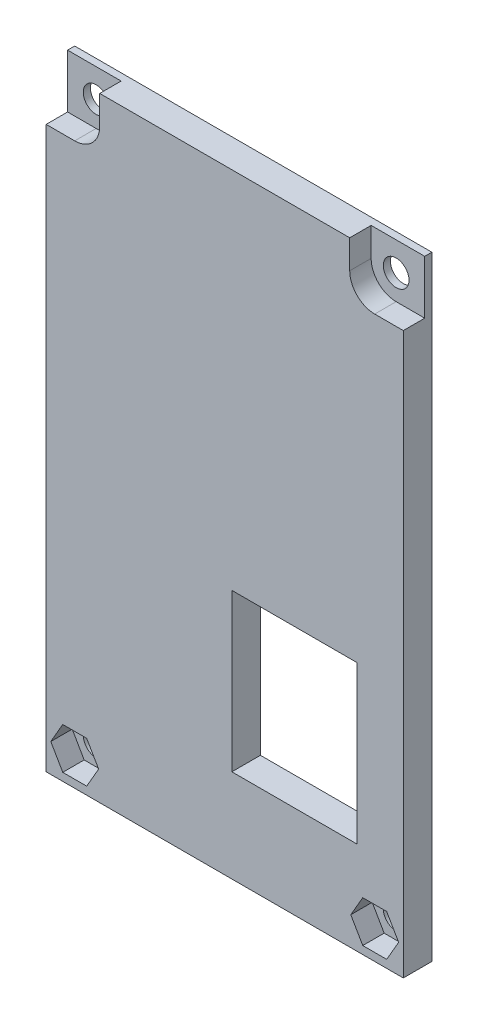
ISO-10303-21;
HEADER;
FILE_DESCRIPTION(('STEP AP214'),'2;1');
FILE_NAME('part.step','',(''),(''),'','','');
FILE_SCHEMA(('AUTOMOTIVE_DESIGN { 1 0 10303 214 1 1 1 1 }'));
ENDSEC;
DATA;
#1=APPLICATION_CONTEXT('core data for automotive mechanical design processes');
#2=APPLICATION_PROTOCOL_DEFINITION('international standard','automotive_design',2000,#1);
#3=PRODUCT_CONTEXT('',#1,'mechanical');
#4=PRODUCT('Part','Part','',(#3));
#5=PRODUCT_RELATED_PRODUCT_CATEGORY('part','',(#4));
#6=PRODUCT_DEFINITION_FORMATION('','',#4);
#7=PRODUCT_DEFINITION_CONTEXT('part definition',#1,'design');
#8=PRODUCT_DEFINITION('design','',#6,#7);
#9=PRODUCT_DEFINITION_SHAPE('','',#8);
#10=(LENGTH_UNIT() NAMED_UNIT(*) SI_UNIT(.MILLI.,.METRE.));
#11=(NAMED_UNIT(*) PLANE_ANGLE_UNIT() SI_UNIT($,.RADIAN.));
#12=(NAMED_UNIT(*) SI_UNIT($,.STERADIAN.) SOLID_ANGLE_UNIT());
#13=UNCERTAINTY_MEASURE_WITH_UNIT(LENGTH_MEASURE(1.E-05),#10,'distance_accuracy_value','');
#14=(GEOMETRIC_REPRESENTATION_CONTEXT(3) GLOBAL_UNCERTAINTY_ASSIGNED_CONTEXT((#13)) GLOBAL_UNIT_ASSIGNED_CONTEXT((#10,
#11,#12)) REPRESENTATION_CONTEXT('',''));
#15=CARTESIAN_POINT('',(0.,0.,0.));
#16=DIRECTION('',(0.,0.,1.));
#17=DIRECTION('',(1.,0.,0.));
#18=AXIS2_PLACEMENT_3D('',#15,#16,#17);
#19=CARTESIAN_POINT('',(575.,343.,4.));
#20=DIRECTION('',(0.,1.,0.));
#21=DIRECTION('',(0.,0.,1.));
#22=AXIS2_PLACEMENT_3D('',#19,#20,#21);
#23=PLANE('',#22);
#24=DIRECTION('',(0.,0.,1.));
#25=VECTOR('',#24,1.);
#26=CARTESIAN_POINT('',(617.5,343.,1.));
#27=LINE('',#26,#25);
#28=CARTESIAN_POINT('',(617.5,343.,1.));
#29=VERTEX_POINT('',#28);
#30=CARTESIAN_POINT('',(617.5,343.,4.));
#31=VERTEX_POINT('',#30);
#32=EDGE_CURVE('E282',#29,#31,#27,.T.);
#33=ORIENTED_EDGE('',*,*,#32,.F.);
#34=DIRECTION('',(-1.,0.,0.));
#35=VECTOR('',#34,1.);
#36=CARTESIAN_POINT('',(625.,343.,1.));
#37=LINE('',#36,#35);
#38=CARTESIAN_POINT('',(625.,343.,1.));
#39=VERTEX_POINT('',#38);
#40=EDGE_CURVE('E271',#39,#29,#37,.T.);
#41=ORIENTED_EDGE('',*,*,#40,.F.);
#42=DIRECTION('',(0.,0.,-1.));
#43=VECTOR('',#42,1.);
#44=CARTESIAN_POINT('',(625.,343.,4.));
#45=LINE('',#44,#43);
#46=CARTESIAN_POINT('',(625.,343.,0.));
#47=VERTEX_POINT('',#46);
#48=EDGE_CURVE('E410',#39,#47,#45,.T.);
#49=ORIENTED_EDGE('',*,*,#48,.T.);
#50=DIRECTION('',(1.,0.,0.));
#51=VECTOR('',#50,1.);
#52=CARTESIAN_POINT('',(575.,343.,0.));
#53=LINE('',#52,#51);
#54=CARTESIAN_POINT('',(575.,343.,0.));
#55=VERTEX_POINT('',#54);
#56=EDGE_CURVE('E391',#55,#47,#53,.T.);
#57=ORIENTED_EDGE('',*,*,#56,.F.);
#58=DIRECTION('',(0.,0.,-1.));
#59=VECTOR('',#58,1.);
#60=CARTESIAN_POINT('',(575.,343.,4.));
#61=LINE('',#60,#59);
#62=CARTESIAN_POINT('',(575.,343.,1.));
#63=VERTEX_POINT('',#62);
#64=EDGE_CURVE('E421',#63,#55,#61,.T.);
#65=ORIENTED_EDGE('',*,*,#64,.F.);
#66=DIRECTION('',(-1.,0.,0.));
#67=VECTOR('',#66,1.);
#68=CARTESIAN_POINT('',(582.5,343.,1.));
#69=LINE('',#68,#67);
#70=CARTESIAN_POINT('',(582.5,343.,1.));
#71=VERTEX_POINT('',#70);
#72=EDGE_CURVE('E303',#71,#63,#69,.T.);
#73=ORIENTED_EDGE('',*,*,#72,.F.);
#74=DIRECTION('',(0.,0.,-1.));
#75=VECTOR('',#74,1.);
#76=CARTESIAN_POINT('',(582.5,343.,4.));
#77=LINE('',#76,#75);
#78=CARTESIAN_POINT('',(582.5,343.,4.));
#79=VERTEX_POINT('',#78);
#80=EDGE_CURVE('E295',#79,#71,#77,.T.);
#81=ORIENTED_EDGE('',*,*,#80,.F.);
#82=DIRECTION('',(1.,0.,0.));
#83=VECTOR('',#82,1.);
#84=CARTESIAN_POINT('',(575.,343.,4.));
#85=LINE('',#84,#83);
#86=EDGE_CURVE('E398',#79,#31,#85,.T.);
#87=ORIENTED_EDGE('',*,*,#86,.T.);
#88=EDGE_LOOP('',(#33,#41,#49,#57,#65,#73,#81,#87));
#89=FACE_BOUND('',#88,.T.);
#90=ADVANCED_FACE('F33',(#89),#23,.T.);
#91=CARTESIAN_POINT('',(575.,257.,4.));
#92=DIRECTION('',(-1.,0.,0.));
#93=DIRECTION('',(0.,0.,1.));
#94=AXIS2_PLACEMENT_3D('',#91,#92,#93);
#95=PLANE('',#94);
#96=DIRECTION('',(0.,1.,0.));
#97=VECTOR('',#96,1.);
#98=CARTESIAN_POINT('',(575.,335.5,1.));
#99=LINE('',#98,#97);
#100=CARTESIAN_POINT('',(575.,335.5,1.));
#101=VERTEX_POINT('',#100);
#102=EDGE_CURVE('E311',#101,#63,#99,.T.);
#103=ORIENTED_EDGE('',*,*,#102,.T.);
#104=ORIENTED_EDGE('',*,*,#64,.T.);
#105=DIRECTION('',(0.,1.,0.));
#106=VECTOR('',#105,1.);
#107=CARTESIAN_POINT('',(575.,257.,0.));
#108=LINE('',#107,#106);
#109=CARTESIAN_POINT('',(575.,257.,0.));
#110=VERTEX_POINT('',#109);
#111=EDGE_CURVE('E402',#110,#55,#108,.T.);
#112=ORIENTED_EDGE('',*,*,#111,.F.);
#113=DIRECTION('',(0.,0.,-1.));
#114=VECTOR('',#113,1.);
#115=CARTESIAN_POINT('',(575.,257.,4.));
#116=LINE('',#115,#114);
#117=CARTESIAN_POINT('',(575.,257.,4.));
#118=VERTEX_POINT('',#117);
#119=EDGE_CURVE('E424',#118,#110,#116,.T.);
#120=ORIENTED_EDGE('',*,*,#119,.F.);
#121=DIRECTION('',(0.,1.,0.));
#122=VECTOR('',#121,1.);
#123=CARTESIAN_POINT('',(575.,257.,4.));
#124=LINE('',#123,#122);
#125=CARTESIAN_POINT('',(575.,335.5,4.));
#126=VERTEX_POINT('',#125);
#127=EDGE_CURVE('E407',#118,#126,#124,.T.);
#128=ORIENTED_EDGE('',*,*,#127,.T.);
#129=DIRECTION('',(0.,0.,1.));
#130=VECTOR('',#129,1.);
#131=CARTESIAN_POINT('',(575.,335.5,1.));
#132=LINE('',#131,#130);
#133=EDGE_CURVE('E305',#101,#126,#132,.T.);
#134=ORIENTED_EDGE('',*,*,#133,.F.);
#135=EDGE_LOOP('',(#103,#104,#112,#120,#128,#134));
#136=FACE_BOUND('',#135,.T.);
#137=ADVANCED_FACE('F473',(#136),#95,.T.);
#138=CARTESIAN_POINT('',(625.,257.,4.));
#139=DIRECTION('',(0.,-1.,0.));
#140=DIRECTION('',(0.,0.,-1.));
#141=AXIS2_PLACEMENT_3D('',#138,#139,#140);
#142=PLANE('',#141);
#143=DIRECTION('',(-1.,0.,0.));
#144=VECTOR('',#143,1.);
#145=CARTESIAN_POINT('',(625.,257.,0.));
#146=LINE('',#145,#144);
#147=CARTESIAN_POINT('',(625.,257.,0.));
#148=VERTEX_POINT('',#147);
#149=EDGE_CURVE('E416',#148,#110,#146,.T.);
#150=ORIENTED_EDGE('',*,*,#149,.F.);
#151=DIRECTION('',(0.,0.,-1.));
#152=VECTOR('',#151,1.);
#153=CARTESIAN_POINT('',(625.,257.,4.));
#154=LINE('',#153,#152);
#155=CARTESIAN_POINT('',(625.,257.,4.));
#156=VERTEX_POINT('',#155);
#157=EDGE_CURVE('E426',#156,#148,#154,.T.);
#158=ORIENTED_EDGE('',*,*,#157,.F.);
#159=DIRECTION('',(-1.,0.,0.));
#160=VECTOR('',#159,1.);
#161=CARTESIAN_POINT('',(625.,257.,4.));
#162=LINE('',#161,#160);
#163=EDGE_CURVE('E404',#156,#118,#162,.T.);
#164=ORIENTED_EDGE('',*,*,#163,.T.);
#165=ORIENTED_EDGE('',*,*,#119,.T.);
#166=EDGE_LOOP('',(#150,#158,#164,#165));
#167=FACE_BOUND('',#166,.T.);
#168=ADVANCED_FACE('F480',(#167),#142,.T.);
#169=CARTESIAN_POINT('',(625.,343.,4.));
#170=DIRECTION('',(1.,0.,0.));
#171=DIRECTION('',(0.,0.,-1.));
#172=AXIS2_PLACEMENT_3D('',#169,#170,#171);
#173=PLANE('',#172);
#174=DIRECTION('',(0.,1.,0.));
#175=VECTOR('',#174,1.);
#176=CARTESIAN_POINT('',(625.,335.5,1.));
#177=LINE('',#176,#175);
#178=CARTESIAN_POINT('',(625.,335.5,1.));
#179=VERTEX_POINT('',#178);
#180=EDGE_CURVE('E288',#179,#39,#177,.T.);
#181=ORIENTED_EDGE('',*,*,#180,.F.);
#182=DIRECTION('',(0.,0.,-1.));
#183=VECTOR('',#182,1.);
#184=CARTESIAN_POINT('',(625.,335.5,4.));
#185=LINE('',#184,#183);
#186=CARTESIAN_POINT('',(625.,335.5,4.));
#187=VERTEX_POINT('',#186);
#188=EDGE_CURVE('E281',#187,#179,#185,.T.);
#189=ORIENTED_EDGE('',*,*,#188,.F.);
#190=DIRECTION('',(0.,-1.,0.));
#191=VECTOR('',#190,1.);
#192=CARTESIAN_POINT('',(625.,343.,4.));
#193=LINE('',#192,#191);
#194=EDGE_CURVE('E401',#187,#156,#193,.T.);
#195=ORIENTED_EDGE('',*,*,#194,.T.);
#196=ORIENTED_EDGE('',*,*,#157,.T.);
#197=DIRECTION('',(0.,-1.,0.));
#198=VECTOR('',#197,1.);
#199=CARTESIAN_POINT('',(625.,343.,0.));
#200=LINE('',#199,#198);
#201=EDGE_CURVE('E413',#47,#148,#200,.T.);
#202=ORIENTED_EDGE('',*,*,#201,.F.);
#203=ORIENTED_EDGE('',*,*,#48,.F.);
#204=EDGE_LOOP('',(#181,#189,#195,#196,#202,#203));
#205=FACE_BOUND('',#204,.T.);
#206=ADVANCED_FACE('F484',(#205),#173,.T.);
#207=CARTESIAN_POINT('',(0.,0.,4.));
#208=DIRECTION('',(0.,0.,-1.));
#209=DIRECTION('',(-1.,0.,0.));
#210=AXIS2_PLACEMENT_3D('',#207,#208,#209);
#211=PLANE('',#210);
#212=DIRECTION('',(-0.499999999999986,0.866025403784447,0.));
#213=VECTOR('',#212,1.);
#214=CARTESIAN_POINT('',(624.35,261.,4.));
#215=LINE('',#214,#213);
#216=CARTESIAN_POINT('',(624.35,261.,4.));
#217=VERTEX_POINT('',#216);
#218=CARTESIAN_POINT('',(622.675,263.901185102678,4.));
#219=VERTEX_POINT('',#218);
#220=EDGE_CURVE('E258',#217,#219,#215,.T.);
#221=ORIENTED_EDGE('',*,*,#220,.F.);
#222=DIRECTION('',(0.499999999999978,0.866025403784451,0.));
#223=VECTOR('',#222,1.);
#224=CARTESIAN_POINT('',(622.675,258.098814897322,4.));
#225=LINE('',#224,#223);
#226=CARTESIAN_POINT('',(622.675,258.098814897322,4.));
#227=VERTEX_POINT('',#226);
#228=EDGE_CURVE('E223',#227,#217,#225,.T.);
#229=ORIENTED_EDGE('',*,*,#228,.F.);
#230=DIRECTION('',(1.,0.,0.));
#231=VECTOR('',#230,1.);
#232=CARTESIAN_POINT('',(619.325,258.098814897322,4.));
#233=LINE('',#232,#231);
#234=CARTESIAN_POINT('',(619.325,258.098814897322,4.));
#235=VERTEX_POINT('',#234);
#236=EDGE_CURVE('E241',#235,#227,#233,.T.);
#237=ORIENTED_EDGE('',*,*,#236,.F.);
#238=DIRECTION('',(0.499999999999978,-0.866025403784451,0.));
#239=VECTOR('',#238,1.);
#240=CARTESIAN_POINT('',(617.65,261.,4.));
#241=LINE('',#240,#239);
#242=CARTESIAN_POINT('',(617.65,261.,4.));
#243=VERTEX_POINT('',#242);
#244=EDGE_CURVE('E244',#243,#235,#241,.T.);
#245=ORIENTED_EDGE('',*,*,#244,.F.);
#246=DIRECTION('',(-0.499999999999986,-0.866025403784447,0.));
#247=VECTOR('',#246,1.);
#248=CARTESIAN_POINT('',(619.325,263.901185102678,4.));
#249=LINE('',#248,#247);
#250=CARTESIAN_POINT('',(619.325,263.901185102678,4.));
#251=VERTEX_POINT('',#250);
#252=EDGE_CURVE('E264',#251,#243,#249,.T.);
#253=ORIENTED_EDGE('',*,*,#252,.F.);
#254=DIRECTION('',(-1.,0.,0.));
#255=VECTOR('',#254,1.);
#256=CARTESIAN_POINT('',(622.675,263.901185102678,4.));
#257=LINE('',#256,#255);
#258=EDGE_CURVE('E261',#219,#251,#257,.T.);
#259=ORIENTED_EDGE('',*,*,#258,.F.);
#260=EDGE_LOOP('',(#221,#229,#237,#245,#253,#259));
#261=FACE_BOUND('',#260,.T.);
#262=DIRECTION('',(0.499999999999978,0.866025403784451,0.));
#263=VECTOR('',#262,1.);
#264=CARTESIAN_POINT('',(580.675,258.098814897322,4.));
#265=LINE('',#264,#263);
#266=CARTESIAN_POINT('',(580.675,258.098814897322,4.));
#267=VERTEX_POINT('',#266);
#268=CARTESIAN_POINT('',(582.35,261.,4.));
#269=VERTEX_POINT('',#268);
#270=EDGE_CURVE('E339',#267,#269,#265,.T.);
#271=ORIENTED_EDGE('',*,*,#270,.F.);
#272=DIRECTION('',(1.,0.,0.));
#273=VECTOR('',#272,1.);
#274=CARTESIAN_POINT('',(577.325,258.098814897322,4.));
#275=LINE('',#274,#273);
#276=CARTESIAN_POINT('',(577.325,258.098814897322,4.));
#277=VERTEX_POINT('',#276);
#278=EDGE_CURVE('E314',#277,#267,#275,.T.);
#279=ORIENTED_EDGE('',*,*,#278,.F.);
#280=DIRECTION('',(0.499999999999978,-0.866025403784451,0.));
#281=VECTOR('',#280,1.);
#282=CARTESIAN_POINT('',(575.65,261.,4.));
#283=LINE('',#282,#281);
#284=CARTESIAN_POINT('',(575.65,261.,4.));
#285=VERTEX_POINT('',#284);
#286=EDGE_CURVE('E322',#285,#277,#283,.T.);
#287=ORIENTED_EDGE('',*,*,#286,.F.);
#288=DIRECTION('',(-0.499999999999986,-0.866025403784447,0.));
#289=VECTOR('',#288,1.);
#290=CARTESIAN_POINT('',(577.325,263.901185102678,4.));
#291=LINE('',#290,#289);
#292=CARTESIAN_POINT('',(577.325,263.901185102678,4.));
#293=VERTEX_POINT('',#292);
#294=EDGE_CURVE('E348',#293,#285,#291,.T.);
#295=ORIENTED_EDGE('',*,*,#294,.F.);
#296=DIRECTION('',(-1.,0.,0.));
#297=VECTOR('',#296,1.);
#298=CARTESIAN_POINT('',(580.675,263.901185102678,4.));
#299=LINE('',#298,#297);
#300=CARTESIAN_POINT('',(580.675,263.901185102678,4.));
#301=VERTEX_POINT('',#300);
#302=EDGE_CURVE('E345',#301,#293,#299,.T.);
#303=ORIENTED_EDGE('',*,*,#302,.F.);
#304=DIRECTION('',(-0.499999999999986,0.866025403784447,0.));
#305=VECTOR('',#304,1.);
#306=CARTESIAN_POINT('',(582.35,261.,4.));
#307=LINE('',#306,#305);
#308=EDGE_CURVE('E342',#269,#301,#307,.T.);
#309=ORIENTED_EDGE('',*,*,#308,.F.);
#310=EDGE_LOOP('',(#271,#279,#287,#295,#303,#309));
#311=FACE_BOUND('',#310,.T.);
#312=DIRECTION('',(0.,1.,0.));
#313=VECTOR('',#312,1.);
#314=CARTESIAN_POINT('',(618.5,270.,4.));
#315=LINE('',#314,#313);
#316=CARTESIAN_POINT('',(618.5,270.,4.));
#317=VERTEX_POINT('',#316);
#318=CARTESIAN_POINT('',(618.5,292.,4.));
#319=VERTEX_POINT('',#318);
#320=EDGE_CURVE('E381',#317,#319,#315,.T.);
#321=ORIENTED_EDGE('',*,*,#320,.F.);
#322=DIRECTION('',(1.,0.,0.));
#323=VECTOR('',#322,1.);
#324=CARTESIAN_POINT('',(601.,270.,4.));
#325=LINE('',#324,#323);
#326=CARTESIAN_POINT('',(601.,270.,4.));
#327=VERTEX_POINT('',#326);
#328=EDGE_CURVE('E355',#327,#317,#325,.T.);
#329=ORIENTED_EDGE('',*,*,#328,.F.);
#330=DIRECTION('',(0.,-1.,0.));
#331=VECTOR('',#330,1.);
#332=CARTESIAN_POINT('',(601.,292.,4.));
#333=LINE('',#332,#331);
#334=CARTESIAN_POINT('',(601.,292.,4.));
#335=VERTEX_POINT('',#334);
#336=EDGE_CURVE('E370',#335,#327,#333,.T.);
#337=ORIENTED_EDGE('',*,*,#336,.F.);
#338=DIRECTION('',(-1.,0.,0.));
#339=VECTOR('',#338,1.);
#340=CARTESIAN_POINT('',(618.5,292.,4.));
#341=LINE('',#340,#339);
#342=EDGE_CURVE('E384',#319,#335,#341,.T.);
#343=ORIENTED_EDGE('',*,*,#342,.F.);
#344=EDGE_LOOP('',(#321,#329,#337,#343));
#345=FACE_BOUND('',#344,.T.);
#346=DIRECTION('',(1.,0.,0.));
#347=VECTOR('',#346,1.);
#348=CARTESIAN_POINT('',(617.5,335.5,4.));
#349=LINE('',#348,#347);
#350=CARTESIAN_POINT('',(621.,335.5,4.));
#351=VERTEX_POINT('',#350);
#352=EDGE_CURVE('E279',#351,#187,#349,.T.);
#353=ORIENTED_EDGE('',*,*,#352,.F.);
#354=CARTESIAN_POINT('',(621.,339.,4.));
#355=DIRECTION('',(0.,0.,-1.));
#356=DIRECTION('',(-1.,0.,0.));
#357=AXIS2_PLACEMENT_3D('',#354,#355,#356);
#358=CIRCLE('',#357,3.5);
#359=CARTESIAN_POINT('',(617.5,339.,4.));
#360=VERTEX_POINT('',#359);
#361=EDGE_CURVE('E11',#351,#360,#358,.T.);
#362=ORIENTED_EDGE('',*,*,#361,.T.);
#363=DIRECTION('',(0.,1.,0.));
#364=VECTOR('',#363,1.);
#365=CARTESIAN_POINT('',(617.5,335.5,4.));
#366=LINE('',#365,#364);
#367=EDGE_CURVE('E293',#360,#31,#366,.T.);
#368=ORIENTED_EDGE('',*,*,#367,.T.);
#369=ORIENTED_EDGE('',*,*,#86,.F.);
#370=DIRECTION('',(0.,1.,0.));
#371=VECTOR('',#370,1.);
#372=CARTESIAN_POINT('',(582.5,335.5,4.));
#373=LINE('',#372,#371);
#374=CARTESIAN_POINT('',(582.5,339.,4.));
#375=VERTEX_POINT('',#374);
#376=EDGE_CURVE('E307',#375,#79,#373,.T.);
#377=ORIENTED_EDGE('',*,*,#376,.F.);
#378=CARTESIAN_POINT('',(579.,339.,4.));
#379=DIRECTION('',(0.,0.,-1.));
#380=DIRECTION('',(-1.,0.,0.));
#381=AXIS2_PLACEMENT_3D('',#378,#379,#380);
#382=CIRCLE('',#381,3.5);
#383=CARTESIAN_POINT('',(579.,335.5,4.));
#384=VERTEX_POINT('',#383);
#385=EDGE_CURVE('E41',#375,#384,#382,.T.);
#386=ORIENTED_EDGE('',*,*,#385,.T.);
#387=DIRECTION('',(1.,0.,0.));
#388=VECTOR('',#387,1.);
#389=CARTESIAN_POINT('',(575.,335.5,4.));
#390=LINE('',#389,#388);
#391=EDGE_CURVE('E299',#126,#384,#390,.T.);
#392=ORIENTED_EDGE('',*,*,#391,.F.);
#393=ORIENTED_EDGE('',*,*,#127,.F.);
#394=ORIENTED_EDGE('',*,*,#163,.F.);
#395=ORIENTED_EDGE('',*,*,#194,.F.);
#396=EDGE_LOOP('',(#353,#362,#368,#369,#377,#386,#392,#393,#394,#395));
#397=FACE_BOUND('',#396,.T.);
#398=ADVANCED_FACE('F449',(#261,#311,#345,#397),#211,.F.);
#399=CARTESIAN_POINT('',(0.,0.,0.));
#400=DIRECTION('',(0.,0.,-1.));
#401=DIRECTION('',(-1.,0.,0.));
#402=AXIS2_PLACEMENT_3D('',#399,#400,#401);
#403=PLANE('',#402);
#404=CARTESIAN_POINT('',(579.,339.,0.));
#405=DIRECTION('',(0.,0.,-1.));
#406=DIRECTION('',(-1.,0.,0.));
#407=AXIS2_PLACEMENT_3D('',#404,#405,#406);
#408=CIRCLE('',#407,1.80000000000002);
#409=CARTESIAN_POINT('',(577.2,339.,0.));
#410=VERTEX_POINT('',#409);
#411=EDGE_CURVE('E870',#410,#410,#408,.T.);
#412=ORIENTED_EDGE('',*,*,#411,.F.);
#413=EDGE_LOOP('',(#412));
#414=FACE_BOUND('',#413,.T.);
#415=CARTESIAN_POINT('',(621.,339.,0.));
#416=DIRECTION('',(0.,0.,-1.));
#417=DIRECTION('',(-1.,0.,0.));
#418=AXIS2_PLACEMENT_3D('',#415,#416,#417);
#419=CIRCLE('',#418,1.80000000000002);
#420=CARTESIAN_POINT('',(619.2,339.,0.));
#421=VERTEX_POINT('',#420);
#422=EDGE_CURVE('E862',#421,#421,#419,.T.);
#423=ORIENTED_EDGE('',*,*,#422,.F.);
#424=EDGE_LOOP('',(#423));
#425=FACE_BOUND('',#424,.T.);
#426=CARTESIAN_POINT('',(579.,261.,0.));
#427=DIRECTION('',(0.,0.,-1.));
#428=DIRECTION('',(-1.,0.,0.));
#429=AXIS2_PLACEMENT_3D('',#426,#427,#428);
#430=CIRCLE('',#429,1.80000000000002);
#431=CARTESIAN_POINT('',(577.2,261.,0.));
#432=VERTEX_POINT('',#431);
#433=EDGE_CURVE('E434',#432,#432,#430,.T.);
#434=ORIENTED_EDGE('',*,*,#433,.F.);
#435=EDGE_LOOP('',(#434));
#436=FACE_BOUND('',#435,.T.);
#437=CARTESIAN_POINT('',(621.,261.,0.));
#438=DIRECTION('',(0.,0.,-1.));
#439=DIRECTION('',(-1.,0.,0.));
#440=AXIS2_PLACEMENT_3D('',#437,#438,#439);
#441=CIRCLE('',#440,1.80000000000002);
#442=CARTESIAN_POINT('',(619.2,261.,0.));
#443=VERTEX_POINT('',#442);
#444=EDGE_CURVE('E247',#443,#443,#441,.T.);
#445=ORIENTED_EDGE('',*,*,#444,.F.);
#446=EDGE_LOOP('',(#445));
#447=FACE_BOUND('',#446,.T.);
#448=DIRECTION('',(1.,0.,0.));
#449=VECTOR('',#448,1.);
#450=CARTESIAN_POINT('',(601.,270.,0.));
#451=LINE('',#450,#449);
#452=CARTESIAN_POINT('',(601.,270.,0.));
#453=VERTEX_POINT('',#452);
#454=CARTESIAN_POINT('',(618.5,270.,0.));
#455=VERTEX_POINT('',#454);
#456=EDGE_CURVE('E366',#453,#455,#451,.T.);
#457=ORIENTED_EDGE('',*,*,#456,.T.);
#458=DIRECTION('',(0.,1.,0.));
#459=VECTOR('',#458,1.);
#460=CARTESIAN_POINT('',(618.5,270.,0.));
#461=LINE('',#460,#459);
#462=CARTESIAN_POINT('',(618.5,292.,0.));
#463=VERTEX_POINT('',#462);
#464=EDGE_CURVE('E369',#455,#463,#461,.T.);
#465=ORIENTED_EDGE('',*,*,#464,.T.);
#466=DIRECTION('',(-1.,0.,0.));
#467=VECTOR('',#466,1.);
#468=CARTESIAN_POINT('',(618.5,292.,0.));
#469=LINE('',#468,#467);
#470=CARTESIAN_POINT('',(601.,292.,0.));
#471=VERTEX_POINT('',#470);
#472=EDGE_CURVE('E373',#463,#471,#469,.T.);
#473=ORIENTED_EDGE('',*,*,#472,.T.);
#474=DIRECTION('',(0.,-1.,0.));
#475=VECTOR('',#474,1.);
#476=CARTESIAN_POINT('',(601.,292.,0.));
#477=LINE('',#476,#475);
#478=EDGE_CURVE('E376',#471,#453,#477,.T.);
#479=ORIENTED_EDGE('',*,*,#478,.T.);
#480=EDGE_LOOP('',(#457,#465,#473,#479));
#481=FACE_BOUND('',#480,.T.);
#482=ORIENTED_EDGE('',*,*,#56,.T.);
#483=ORIENTED_EDGE('',*,*,#201,.T.);
#484=ORIENTED_EDGE('',*,*,#149,.T.);
#485=ORIENTED_EDGE('',*,*,#111,.T.);
#486=EDGE_LOOP('',(#482,#483,#484,#485));
#487=FACE_BOUND('',#486,.T.);
#488=ADVANCED_FACE('F497',(#414,#425,#436,#447,#481,#487),#403,.T.);
#489=CARTESIAN_POINT('',(601.,270.,0.));
#490=DIRECTION('',(0.,-1.,0.));
#491=DIRECTION('',(0.,0.,-1.));
#492=AXIS2_PLACEMENT_3D('',#489,#490,#491);
#493=PLANE('',#492);
#494=ORIENTED_EDGE('',*,*,#328,.T.);
#495=DIRECTION('',(0.,0.,1.));
#496=VECTOR('',#495,1.);
#497=CARTESIAN_POINT('',(618.5,270.,0.));
#498=LINE('',#497,#496);
#499=EDGE_CURVE('E379',#455,#317,#498,.T.);
#500=ORIENTED_EDGE('',*,*,#499,.F.);
#501=ORIENTED_EDGE('',*,*,#456,.F.);
#502=DIRECTION('',(0.,0.,1.));
#503=VECTOR('',#502,1.);
#504=CARTESIAN_POINT('',(601.,270.,0.));
#505=LINE('',#504,#503);
#506=EDGE_CURVE('E389',#453,#327,#505,.T.);
#507=ORIENTED_EDGE('',*,*,#506,.T.);
#508=EDGE_LOOP('',(#494,#500,#501,#507));
#509=FACE_BOUND('',#508,.T.);
#510=ADVANCED_FACE('F499',(#509),#493,.F.);
#511=CARTESIAN_POINT('',(601.,292.,0.));
#512=DIRECTION('',(-1.,0.,0.));
#513=DIRECTION('',(0.,0.,1.));
#514=AXIS2_PLACEMENT_3D('',#511,#512,#513);
#515=PLANE('',#514);
#516=ORIENTED_EDGE('',*,*,#336,.T.);
#517=ORIENTED_EDGE('',*,*,#506,.F.);
#518=ORIENTED_EDGE('',*,*,#478,.F.);
#519=DIRECTION('',(0.,0.,1.));
#520=VECTOR('',#519,1.);
#521=CARTESIAN_POINT('',(601.,292.,0.));
#522=LINE('',#521,#520);
#523=EDGE_CURVE('E392',#471,#335,#522,.T.);
#524=ORIENTED_EDGE('',*,*,#523,.T.);
#525=EDGE_LOOP('',(#516,#517,#518,#524));
#526=FACE_BOUND('',#525,.T.);
#527=ADVANCED_FACE('F506',(#526),#515,.F.);
#528=CARTESIAN_POINT('',(618.5,292.,0.));
#529=DIRECTION('',(0.,1.,0.));
#530=DIRECTION('',(0.,0.,1.));
#531=AXIS2_PLACEMENT_3D('',#528,#529,#530);
#532=PLANE('',#531);
#533=ORIENTED_EDGE('',*,*,#342,.T.);
#534=ORIENTED_EDGE('',*,*,#523,.F.);
#535=ORIENTED_EDGE('',*,*,#472,.F.);
#536=DIRECTION('',(0.,0.,1.));
#537=VECTOR('',#536,1.);
#538=CARTESIAN_POINT('',(618.5,292.,0.));
#539=LINE('',#538,#537);
#540=EDGE_CURVE('E394',#463,#319,#539,.T.);
#541=ORIENTED_EDGE('',*,*,#540,.T.);
#542=EDGE_LOOP('',(#533,#534,#535,#541));
#543=FACE_BOUND('',#542,.T.);
#544=ADVANCED_FACE('F614',(#543),#532,.F.);
#545=CARTESIAN_POINT('',(618.5,270.,0.));
#546=DIRECTION('',(1.,0.,0.));
#547=DIRECTION('',(0.,0.,-1.));
#548=AXIS2_PLACEMENT_3D('',#545,#546,#547);
#549=PLANE('',#548);
#550=ORIENTED_EDGE('',*,*,#320,.T.);
#551=ORIENTED_EDGE('',*,*,#540,.F.);
#552=ORIENTED_EDGE('',*,*,#464,.F.);
#553=ORIENTED_EDGE('',*,*,#499,.T.);
#554=EDGE_LOOP('',(#550,#551,#552,#553));
#555=FACE_BOUND('',#554,.T.);
#556=ADVANCED_FACE('F610',(#555),#549,.F.);
#557=CARTESIAN_POINT('',(577.325,258.098814897322,1.));
#558=DIRECTION('',(0.,-1.,0.));
#559=DIRECTION('',(0.,0.,-1.));
#560=AXIS2_PLACEMENT_3D('',#557,#558,#559);
#561=PLANE('',#560);
#562=ORIENTED_EDGE('',*,*,#278,.T.);
#563=DIRECTION('',(0.,0.,1.));
#564=VECTOR('',#563,1.);
#565=CARTESIAN_POINT('',(580.675,258.098814897322,1.));
#566=LINE('',#565,#564);
#567=CARTESIAN_POINT('',(580.675,258.098814897322,1.));
#568=VERTEX_POINT('',#567);
#569=EDGE_CURVE('E337',#568,#267,#566,.T.);
#570=ORIENTED_EDGE('',*,*,#569,.F.);
#571=DIRECTION('',(1.,0.,0.));
#572=VECTOR('',#571,1.);
#573=CARTESIAN_POINT('',(577.325,258.098814897322,1.));
#574=LINE('',#573,#572);
#575=CARTESIAN_POINT('',(577.325,258.098814897322,1.));
#576=VERTEX_POINT('',#575);
#577=EDGE_CURVE('E318',#576,#568,#574,.T.);
#578=ORIENTED_EDGE('',*,*,#577,.F.);
#579=DIRECTION('',(0.,0.,1.));
#580=VECTOR('',#579,1.);
#581=CARTESIAN_POINT('',(577.325,258.098814897322,1.));
#582=LINE('',#581,#580);
#583=EDGE_CURVE('E353',#576,#277,#582,.T.);
#584=ORIENTED_EDGE('',*,*,#583,.T.);
#585=EDGE_LOOP('',(#562,#570,#578,#584));
#586=FACE_BOUND('',#585,.T.);
#587=ADVANCED_FACE('F592',(#586),#561,.F.);
#588=CARTESIAN_POINT('',(575.65,261.,1.));
#589=DIRECTION('',(-0.866025403784451,-0.499999999999978,0.));
#590=DIRECTION('',(0.499999999999978,-0.866025403784451,0.));
#591=AXIS2_PLACEMENT_3D('',#588,#589,#590);
#592=PLANE('',#591);
#593=ORIENTED_EDGE('',*,*,#286,.T.);
#594=ORIENTED_EDGE('',*,*,#583,.F.);
#595=DIRECTION('',(0.499999999999978,-0.866025403784451,0.));
#596=VECTOR('',#595,1.);
#597=CARTESIAN_POINT('',(575.65,261.,1.));
#598=LINE('',#597,#596);
#599=CARTESIAN_POINT('',(575.65,261.,1.));
#600=VERTEX_POINT('',#599);
#601=EDGE_CURVE('E334',#600,#576,#598,.T.);
#602=ORIENTED_EDGE('',*,*,#601,.F.);
#603=DIRECTION('',(0.,0.,1.));
#604=VECTOR('',#603,1.);
#605=CARTESIAN_POINT('',(575.65,261.,1.));
#606=LINE('',#605,#604);
#607=EDGE_CURVE('E356',#600,#285,#606,.T.);
#608=ORIENTED_EDGE('',*,*,#607,.T.);
#609=EDGE_LOOP('',(#593,#594,#602,#608));
#610=FACE_BOUND('',#609,.T.);
#611=ADVANCED_FACE('F588',(#610),#592,.F.);
#612=CARTESIAN_POINT('',(577.325,263.901185102678,1.));
#613=DIRECTION('',(-0.866025403784447,0.499999999999986,0.));
#614=DIRECTION('',(-0.499999999999986,-0.866025403784447,0.));
#615=AXIS2_PLACEMENT_3D('',#612,#613,#614);
#616=PLANE('',#615);
#617=ORIENTED_EDGE('',*,*,#294,.T.);
#618=ORIENTED_EDGE('',*,*,#607,.F.);
#619=DIRECTION('',(-0.499999999999986,-0.866025403784447,0.));
#620=VECTOR('',#619,1.);
#621=CARTESIAN_POINT('',(577.325,263.901185102678,1.));
#622=LINE('',#621,#620);
#623=CARTESIAN_POINT('',(577.325,263.901185102678,1.));
#624=VERTEX_POINT('',#623);
#625=EDGE_CURVE('E331',#624,#600,#622,.T.);
#626=ORIENTED_EDGE('',*,*,#625,.F.);
#627=DIRECTION('',(0.,0.,1.));
#628=VECTOR('',#627,1.);
#629=CARTESIAN_POINT('',(577.325,263.901185102678,1.));
#630=LINE('',#629,#628);
#631=EDGE_CURVE('E358',#624,#293,#630,.T.);
#632=ORIENTED_EDGE('',*,*,#631,.T.);
#633=EDGE_LOOP('',(#617,#618,#626,#632));
#634=FACE_BOUND('',#633,.T.);
#635=ADVANCED_FACE('F591',(#634),#616,.F.);
#636=CARTESIAN_POINT('',(580.675,263.901185102678,1.));
#637=DIRECTION('',(0.,1.,0.));
#638=DIRECTION('',(0.,0.,1.));
#639=AXIS2_PLACEMENT_3D('',#636,#637,#638);
#640=PLANE('',#639);
#641=ORIENTED_EDGE('',*,*,#302,.T.);
#642=ORIENTED_EDGE('',*,*,#631,.F.);
#643=DIRECTION('',(-1.,0.,0.));
#644=VECTOR('',#643,1.);
#645=CARTESIAN_POINT('',(580.675,263.901185102678,1.));
#646=LINE('',#645,#644);
#647=CARTESIAN_POINT('',(580.675,263.901185102678,1.));
#648=VERTEX_POINT('',#647);
#649=EDGE_CURVE('E328',#648,#624,#646,.T.);
#650=ORIENTED_EDGE('',*,*,#649,.F.);
#651=DIRECTION('',(0.,0.,1.));
#652=VECTOR('',#651,1.);
#653=CARTESIAN_POINT('',(580.675,263.901185102678,1.));
#654=LINE('',#653,#652);
#655=EDGE_CURVE('E360',#648,#301,#654,.T.);
#656=ORIENTED_EDGE('',*,*,#655,.T.);
#657=EDGE_LOOP('',(#641,#642,#650,#656));
#658=FACE_BOUND('',#657,.T.);
#659=ADVANCED_FACE('F596',(#658),#640,.F.);
#660=CARTESIAN_POINT('',(582.35,261.,1.));
#661=DIRECTION('',(0.866025403784447,0.499999999999986,0.));
#662=DIRECTION('',(-0.499999999999986,0.866025403784447,0.));
#663=AXIS2_PLACEMENT_3D('',#660,#661,#662);
#664=PLANE('',#663);
#665=ORIENTED_EDGE('',*,*,#308,.T.);
#666=ORIENTED_EDGE('',*,*,#655,.F.);
#667=DIRECTION('',(-0.499999999999986,0.866025403784447,0.));
#668=VECTOR('',#667,1.);
#669=CARTESIAN_POINT('',(582.35,261.,1.));
#670=LINE('',#669,#668);
#671=CARTESIAN_POINT('',(582.35,261.,1.));
#672=VERTEX_POINT('',#671);
#673=EDGE_CURVE('E325',#672,#648,#670,.T.);
#674=ORIENTED_EDGE('',*,*,#673,.F.);
#675=DIRECTION('',(0.,0.,1.));
#676=VECTOR('',#675,1.);
#677=CARTESIAN_POINT('',(582.35,261.,1.));
#678=LINE('',#677,#676);
#679=EDGE_CURVE('E362',#672,#269,#678,.T.);
#680=ORIENTED_EDGE('',*,*,#679,.T.);
#681=EDGE_LOOP('',(#665,#666,#674,#680));
#682=FACE_BOUND('',#681,.T.);
#683=ADVANCED_FACE('F600',(#682),#664,.F.);
#684=CARTESIAN_POINT('',(580.675,258.098814897322,1.));
#685=DIRECTION('',(0.866025403784451,-0.499999999999978,0.));
#686=DIRECTION('',(0.499999999999978,0.866025403784451,0.));
#687=AXIS2_PLACEMENT_3D('',#684,#685,#686);
#688=PLANE('',#687);
#689=ORIENTED_EDGE('',*,*,#270,.T.);
#690=ORIENTED_EDGE('',*,*,#679,.F.);
#691=DIRECTION('',(0.499999999999978,0.866025403784451,0.));
#692=VECTOR('',#691,1.);
#693=CARTESIAN_POINT('',(580.675,258.098814897322,1.));
#694=LINE('',#693,#692);
#695=EDGE_CURVE('E321',#568,#672,#694,.T.);
#696=ORIENTED_EDGE('',*,*,#695,.F.);
#697=ORIENTED_EDGE('',*,*,#569,.T.);
#698=EDGE_LOOP('',(#689,#690,#696,#697));
#699=FACE_BOUND('',#698,.T.);
#700=ADVANCED_FACE('F586',(#699),#688,.F.);
#701=CARTESIAN_POINT('',(0.,0.,1.));
#702=DIRECTION('',(0.,0.,1.));
#703=DIRECTION('',(1.,0.,0.));
#704=AXIS2_PLACEMENT_3D('',#701,#702,#703);
#705=PLANE('',#704);
#706=CARTESIAN_POINT('',(579.,261.,1.));
#707=DIRECTION('',(0.,0.,1.));
#708=DIRECTION('',(1.,0.,0.));
#709=AXIS2_PLACEMENT_3D('',#706,#707,#708);
#710=CIRCLE('',#709,1.80000000000002);
#711=CARTESIAN_POINT('',(580.8,261.,1.));
#712=VERTEX_POINT('',#711);
#713=EDGE_CURVE('E431',#712,#712,#710,.T.);
#714=ORIENTED_EDGE('',*,*,#713,.F.);
#715=EDGE_LOOP('',(#714));
#716=FACE_BOUND('',#715,.T.);
#717=ORIENTED_EDGE('',*,*,#577,.T.);
#718=ORIENTED_EDGE('',*,*,#695,.T.);
#719=ORIENTED_EDGE('',*,*,#673,.T.);
#720=ORIENTED_EDGE('',*,*,#649,.T.);
#721=ORIENTED_EDGE('',*,*,#625,.T.);
#722=ORIENTED_EDGE('',*,*,#601,.T.);
#723=EDGE_LOOP('',(#717,#718,#719,#720,#721,#722));
#724=FACE_BOUND('',#723,.T.);
#725=ADVANCED_FACE('F580',(#716,#724),#705,.T.);
#726=CARTESIAN_POINT('',(582.5,335.5,1.));
#727=DIRECTION('',(0.,0.,-1.));
#728=DIRECTION('',(-1.,0.,0.));
#729=AXIS2_PLACEMENT_3D('',#726,#727,#728);
#730=PLANE('',#729);
#731=CARTESIAN_POINT('',(579.,339.,1.));
#732=DIRECTION('',(0.,0.,-1.));
#733=DIRECTION('',(-1.,0.,0.));
#734=AXIS2_PLACEMENT_3D('',#731,#732,#733);
#735=CIRCLE('',#734,1.80000000000002);
#736=CARTESIAN_POINT('',(577.2,339.,1.));
#737=VERTEX_POINT('',#736);
#738=EDGE_CURVE('E867',#737,#737,#735,.T.);
#739=ORIENTED_EDGE('',*,*,#738,.T.);
#740=EDGE_LOOP('',(#739));
#741=FACE_BOUND('',#740,.T.);
#742=DIRECTION('',(-1.,0.,0.));
#743=VECTOR('',#742,1.);
#744=CARTESIAN_POINT('',(582.5,335.5,1.));
#745=LINE('',#744,#743);
#746=CARTESIAN_POINT('',(579.,335.5,1.));
#747=VERTEX_POINT('',#746);
#748=EDGE_CURVE('E302',#747,#101,#745,.T.);
#749=ORIENTED_EDGE('',*,*,#748,.F.);
#750=CARTESIAN_POINT('',(579.,339.,1.));
#751=DIRECTION('',(0.,0.,-1.));
#752=DIRECTION('',(-1.,0.,0.));
#753=AXIS2_PLACEMENT_3D('',#750,#751,#752);
#754=CIRCLE('',#753,3.5);
#755=CARTESIAN_POINT('',(582.5,339.,1.));
#756=VERTEX_POINT('',#755);
#757=EDGE_CURVE('E437',#747,#756,#754,.F.);
#758=ORIENTED_EDGE('',*,*,#757,.T.);
#759=DIRECTION('',(0.,1.,0.));
#760=VECTOR('',#759,1.);
#761=CARTESIAN_POINT('',(582.5,335.5,1.));
#762=LINE('',#761,#760);
#763=EDGE_CURVE('E315',#756,#71,#762,.T.);
#764=ORIENTED_EDGE('',*,*,#763,.T.);
#765=ORIENTED_EDGE('',*,*,#72,.T.);
#766=ORIENTED_EDGE('',*,*,#102,.F.);
#767=EDGE_LOOP('',(#749,#758,#764,#765,#766));
#768=FACE_BOUND('',#767,.T.);
#769=ADVANCED_FACE('F462',(#741,#768),#730,.F.);
#770=CARTESIAN_POINT('',(582.5,335.5,4.));
#771=DIRECTION('',(1.,0.,0.));
#772=DIRECTION('',(0.,0.,-1.));
#773=AXIS2_PLACEMENT_3D('',#770,#771,#772);
#774=PLANE('',#773);
#775=ORIENTED_EDGE('',*,*,#763,.F.);
#776=DIRECTION('',(0.,0.,-1.));
#777=VECTOR('',#776,1.);
#778=CARTESIAN_POINT('',(582.5,339.,4.));
#779=LINE('',#778,#777);
#780=EDGE_CURVE('E439',#756,#375,#779,.F.);
#781=ORIENTED_EDGE('',*,*,#780,.T.);
#782=ORIENTED_EDGE('',*,*,#376,.T.);
#783=ORIENTED_EDGE('',*,*,#80,.T.);
#784=EDGE_LOOP('',(#775,#781,#782,#783));
#785=FACE_BOUND('',#784,.T.);
#786=ADVANCED_FACE('F465',(#785),#774,.F.);
#787=CARTESIAN_POINT('',(0.,335.5,0.));
#788=DIRECTION('',(0.,1.,0.));
#789=DIRECTION('',(0.,0.,1.));
#790=AXIS2_PLACEMENT_3D('',#787,#788,#789);
#791=PLANE('',#790);
#792=ORIENTED_EDGE('',*,*,#391,.T.);
#793=DIRECTION('',(0.,0.,-1.));
#794=VECTOR('',#793,1.);
#795=CARTESIAN_POINT('',(579.,335.5,0.));
#796=LINE('',#795,#794);
#797=EDGE_CURVE('E423',#384,#747,#796,.T.);
#798=ORIENTED_EDGE('',*,*,#797,.T.);
#799=ORIENTED_EDGE('',*,*,#748,.T.);
#800=ORIENTED_EDGE('',*,*,#133,.T.);
#801=EDGE_LOOP('',(#792,#798,#799,#800));
#802=FACE_BOUND('',#801,.T.);
#803=ADVANCED_FACE('F456',(#802),#791,.T.);
#804=CARTESIAN_POINT('',(617.5,335.5,1.));
#805=DIRECTION('',(-1.,0.,0.));
#806=DIRECTION('',(0.,0.,1.));
#807=AXIS2_PLACEMENT_3D('',#804,#805,#806);
#808=PLANE('',#807);
#809=ORIENTED_EDGE('',*,*,#367,.F.);
#810=DIRECTION('',(0.,0.,1.));
#811=VECTOR('',#810,1.);
#812=CARTESIAN_POINT('',(617.5,339.,1.));
#813=LINE('',#812,#811);
#814=CARTESIAN_POINT('',(617.5,339.,1.));
#815=VERTEX_POINT('',#814);
#816=EDGE_CURVE('E48',#360,#815,#813,.F.);
#817=ORIENTED_EDGE('',*,*,#816,.T.);
#818=DIRECTION('',(0.,1.,0.));
#819=VECTOR('',#818,1.);
#820=CARTESIAN_POINT('',(617.5,335.5,1.));
#821=LINE('',#820,#819);
#822=EDGE_CURVE('E296',#815,#29,#821,.T.);
#823=ORIENTED_EDGE('',*,*,#822,.T.);
#824=ORIENTED_EDGE('',*,*,#32,.T.);
#825=EDGE_LOOP('',(#809,#817,#823,#824));
#826=FACE_BOUND('',#825,.T.);
#827=ADVANCED_FACE('F495',(#826),#808,.F.);
#828=CARTESIAN_POINT('',(625.,335.5,1.));
#829=DIRECTION('',(0.,0.,-1.));
#830=DIRECTION('',(-1.,0.,0.));
#831=AXIS2_PLACEMENT_3D('',#828,#829,#830);
#832=PLANE('',#831);
#833=CARTESIAN_POINT('',(621.,339.,1.));
#834=DIRECTION('',(0.,0.,-1.));
#835=DIRECTION('',(-1.,0.,0.));
#836=AXIS2_PLACEMENT_3D('',#833,#834,#835);
#837=CIRCLE('',#836,1.80000000000002);
#838=CARTESIAN_POINT('',(619.2,339.,1.));
#839=VERTEX_POINT('',#838);
#840=EDGE_CURVE('E860',#839,#839,#837,.T.);
#841=ORIENTED_EDGE('',*,*,#840,.T.);
#842=EDGE_LOOP('',(#841));
#843=FACE_BOUND('',#842,.T.);
#844=ORIENTED_EDGE('',*,*,#822,.F.);
#845=CARTESIAN_POINT('',(621.,339.,1.));
#846=DIRECTION('',(0.,0.,-1.));
#847=DIRECTION('',(-1.,0.,0.));
#848=AXIS2_PLACEMENT_3D('',#845,#846,#847);
#849=CIRCLE('',#848,3.5);
#850=CARTESIAN_POINT('',(621.,335.5,1.));
#851=VERTEX_POINT('',#850);
#852=EDGE_CURVE('E445',#815,#851,#849,.F.);
#853=ORIENTED_EDGE('',*,*,#852,.T.);
#854=DIRECTION('',(-1.,0.,0.));
#855=VECTOR('',#854,1.);
#856=CARTESIAN_POINT('',(625.,335.5,1.));
#857=LINE('',#856,#855);
#858=EDGE_CURVE('E285',#179,#851,#857,.T.);
#859=ORIENTED_EDGE('',*,*,#858,.F.);
#860=ORIENTED_EDGE('',*,*,#180,.T.);
#861=ORIENTED_EDGE('',*,*,#40,.T.);
#862=EDGE_LOOP('',(#844,#853,#859,#860,#861));
#863=FACE_BOUND('',#862,.T.);
#864=ADVANCED_FACE('F493',(#843,#863),#832,.F.);
#865=CARTESIAN_POINT('',(0.,335.5,0.));
#866=DIRECTION('',(0.,1.,0.));
#867=DIRECTION('',(0.,0.,1.));
#868=AXIS2_PLACEMENT_3D('',#865,#866,#867);
#869=PLANE('',#868);
#870=ORIENTED_EDGE('',*,*,#858,.T.);
#871=DIRECTION('',(0.,0.,1.));
#872=VECTOR('',#871,1.);
#873=CARTESIAN_POINT('',(621.,335.5,0.));
#874=LINE('',#873,#872);
#875=EDGE_CURVE('E441',#851,#351,#874,.T.);
#876=ORIENTED_EDGE('',*,*,#875,.T.);
#877=ORIENTED_EDGE('',*,*,#352,.T.);
#878=ORIENTED_EDGE('',*,*,#188,.T.);
#879=EDGE_LOOP('',(#870,#876,#877,#878));
#880=FACE_BOUND('',#879,.T.);
#881=ADVANCED_FACE('F488',(#880),#869,.T.);
#882=CARTESIAN_POINT('',(622.675,258.098814897322,1.));
#883=DIRECTION('',(0.866025403784451,-0.499999999999978,0.));
#884=DIRECTION('',(0.499999999999978,0.866025403784451,0.));
#885=AXIS2_PLACEMENT_3D('',#882,#883,#884);
#886=PLANE('',#885);
#887=ORIENTED_EDGE('',*,*,#228,.T.);
#888=DIRECTION('',(0.,0.,1.));
#889=VECTOR('',#888,1.);
#890=CARTESIAN_POINT('',(624.35,261.,1.));
#891=LINE('',#890,#889);
#892=CARTESIAN_POINT('',(624.35,261.,1.));
#893=VERTEX_POINT('',#892);
#894=EDGE_CURVE('E216',#893,#217,#891,.T.);
#895=ORIENTED_EDGE('',*,*,#894,.F.);
#896=DIRECTION('',(0.499999999999978,0.866025403784451,0.));
#897=VECTOR('',#896,1.);
#898=CARTESIAN_POINT('',(622.675,258.098814897322,1.));
#899=LINE('',#898,#897);
#900=CARTESIAN_POINT('',(622.675,258.098814897322,1.));
#901=VERTEX_POINT('',#900);
#902=EDGE_CURVE('E220',#901,#893,#899,.T.);
#903=ORIENTED_EDGE('',*,*,#902,.F.);
#904=DIRECTION('',(0.,0.,1.));
#905=VECTOR('',#904,1.);
#906=CARTESIAN_POINT('',(622.675,258.098814897322,1.));
#907=LINE('',#906,#905);
#908=EDGE_CURVE('E269',#901,#227,#907,.T.);
#909=ORIENTED_EDGE('',*,*,#908,.T.);
#910=EDGE_LOOP('',(#887,#895,#903,#909));
#911=FACE_BOUND('',#910,.T.);
#912=ADVANCED_FACE('F218',(#911),#886,.F.);
#913=CARTESIAN_POINT('',(619.325,258.098814897322,1.));
#914=DIRECTION('',(0.,-1.,0.));
#915=DIRECTION('',(0.,0.,-1.));
#916=AXIS2_PLACEMENT_3D('',#913,#914,#915);
#917=PLANE('',#916);
#918=ORIENTED_EDGE('',*,*,#236,.T.);
#919=ORIENTED_EDGE('',*,*,#908,.F.);
#920=DIRECTION('',(1.,0.,0.));
#921=VECTOR('',#920,1.);
#922=CARTESIAN_POINT('',(619.325,258.098814897322,1.));
#923=LINE('',#922,#921);
#924=CARTESIAN_POINT('',(619.325,258.098814897322,1.));
#925=VERTEX_POINT('',#924);
#926=EDGE_CURVE('E228',#925,#901,#923,.T.);
#927=ORIENTED_EDGE('',*,*,#926,.F.);
#928=DIRECTION('',(0.,0.,1.));
#929=VECTOR('',#928,1.);
#930=CARTESIAN_POINT('',(619.325,258.098814897322,1.));
#931=LINE('',#930,#929);
#932=EDGE_CURVE('E272',#925,#235,#931,.T.);
#933=ORIENTED_EDGE('',*,*,#932,.T.);
#934=EDGE_LOOP('',(#918,#919,#927,#933));
#935=FACE_BOUND('',#934,.T.);
#936=ADVANCED_FACE('F549',(#935),#917,.F.);
#937=CARTESIAN_POINT('',(617.65,261.,1.));
#938=DIRECTION('',(-0.866025403784451,-0.499999999999978,0.));
#939=DIRECTION('',(0.499999999999978,-0.866025403784451,0.));
#940=AXIS2_PLACEMENT_3D('',#937,#938,#939);
#941=PLANE('',#940);
#942=ORIENTED_EDGE('',*,*,#244,.T.);
#943=ORIENTED_EDGE('',*,*,#932,.F.);
#944=DIRECTION('',(0.499999999999978,-0.866025403784451,0.));
#945=VECTOR('',#944,1.);
#946=CARTESIAN_POINT('',(617.65,261.,1.));
#947=LINE('',#946,#945);
#948=CARTESIAN_POINT('',(617.65,261.,1.));
#949=VERTEX_POINT('',#948);
#950=EDGE_CURVE('E254',#949,#925,#947,.T.);
#951=ORIENTED_EDGE('',*,*,#950,.F.);
#952=DIRECTION('',(0.,0.,1.));
#953=VECTOR('',#952,1.);
#954=CARTESIAN_POINT('',(617.65,261.,1.));
#955=LINE('',#954,#953);
#956=EDGE_CURVE('E274',#949,#243,#955,.T.);
#957=ORIENTED_EDGE('',*,*,#956,.T.);
#958=EDGE_LOOP('',(#942,#943,#951,#957));
#959=FACE_BOUND('',#958,.T.);
#960=ADVANCED_FACE('F552',(#959),#941,.F.);
#961=CARTESIAN_POINT('',(619.325,263.901185102678,1.));
#962=DIRECTION('',(-0.866025403784447,0.499999999999986,0.));
#963=DIRECTION('',(-0.499999999999986,-0.866025403784447,0.));
#964=AXIS2_PLACEMENT_3D('',#961,#962,#963);
#965=PLANE('',#964);
#966=ORIENTED_EDGE('',*,*,#252,.T.);
#967=ORIENTED_EDGE('',*,*,#956,.F.);
#968=DIRECTION('',(-0.499999999999986,-0.866025403784447,0.));
#969=VECTOR('',#968,1.);
#970=CARTESIAN_POINT('',(619.325,263.901185102678,1.));
#971=LINE('',#970,#969);
#972=CARTESIAN_POINT('',(619.325,263.901185102678,1.));
#973=VERTEX_POINT('',#972);
#974=EDGE_CURVE('E251',#973,#949,#971,.T.);
#975=ORIENTED_EDGE('',*,*,#974,.F.);
#976=DIRECTION('',(0.,0.,1.));
#977=VECTOR('',#976,1.);
#978=CARTESIAN_POINT('',(619.325,263.901185102678,1.));
#979=LINE('',#978,#977);
#980=EDGE_CURVE('E276',#973,#251,#979,.T.);
#981=ORIENTED_EDGE('',*,*,#980,.T.);
#982=EDGE_LOOP('',(#966,#967,#975,#981));
#983=FACE_BOUND('',#982,.T.);
#984=ADVANCED_FACE('F556',(#983),#965,.F.);
#985=CARTESIAN_POINT('',(622.675,263.901185102678,1.));
#986=DIRECTION('',(0.,1.,0.));
#987=DIRECTION('',(0.,0.,1.));
#988=AXIS2_PLACEMENT_3D('',#985,#986,#987);
#989=PLANE('',#988);
#990=ORIENTED_EDGE('',*,*,#258,.T.);
#991=ORIENTED_EDGE('',*,*,#980,.F.);
#992=DIRECTION('',(-1.,0.,0.));
#993=VECTOR('',#992,1.);
#994=CARTESIAN_POINT('',(622.675,263.901185102678,1.));
#995=LINE('',#994,#993);
#996=CARTESIAN_POINT('',(622.675,263.901185102678,1.));
#997=VERTEX_POINT('',#996);
#998=EDGE_CURVE('E236',#997,#973,#995,.T.);
#999=ORIENTED_EDGE('',*,*,#998,.F.);
#1000=DIRECTION('',(0.,0.,1.));
#1001=VECTOR('',#1000,1.);
#1002=CARTESIAN_POINT('',(622.675,263.901185102678,1.));
#1003=LINE('',#1002,#1001);
#1004=EDGE_CURVE('E227',#997,#219,#1003,.T.);
#1005=ORIENTED_EDGE('',*,*,#1004,.T.);
#1006=EDGE_LOOP('',(#990,#991,#999,#1005));
#1007=FACE_BOUND('',#1006,.T.);
#1008=ADVANCED_FACE('F560',(#1007),#989,.F.);
#1009=CARTESIAN_POINT('',(624.35,261.,1.));
#1010=DIRECTION('',(0.866025403784447,0.499999999999986,0.));
#1011=DIRECTION('',(-0.499999999999986,0.866025403784447,0.));
#1012=AXIS2_PLACEMENT_3D('',#1009,#1010,#1011);
#1013=PLANE('',#1012);
#1014=ORIENTED_EDGE('',*,*,#220,.T.);
#1015=ORIENTED_EDGE('',*,*,#1004,.F.);
#1016=DIRECTION('',(-0.499999999999986,0.866025403784447,0.));
#1017=VECTOR('',#1016,1.);
#1018=CARTESIAN_POINT('',(624.35,261.,1.));
#1019=LINE('',#1018,#1017);
#1020=EDGE_CURVE('E231',#893,#997,#1019,.T.);
#1021=ORIENTED_EDGE('',*,*,#1020,.F.);
#1022=ORIENTED_EDGE('',*,*,#894,.T.);
#1023=EDGE_LOOP('',(#1014,#1015,#1021,#1022));
#1024=FACE_BOUND('',#1023,.T.);
#1025=ADVANCED_FACE('F232',(#1024),#1013,.F.);
#1026=CARTESIAN_POINT('',(0.,0.,1.));
#1027=DIRECTION('',(0.,0.,1.));
#1028=DIRECTION('',(1.,0.,0.));
#1029=AXIS2_PLACEMENT_3D('',#1026,#1027,#1028);
#1030=PLANE('',#1029);
#1031=CARTESIAN_POINT('',(621.,261.,1.));
#1032=DIRECTION('',(0.,0.,1.));
#1033=DIRECTION('',(1.,0.,0.));
#1034=AXIS2_PLACEMENT_3D('',#1031,#1032,#1033);
#1035=CIRCLE('',#1034,1.80000000000002);
#1036=CARTESIAN_POINT('',(622.8,261.,1.));
#1037=VERTEX_POINT('',#1036);
#1038=EDGE_CURVE('E259',#1037,#1037,#1035,.T.);
#1039=ORIENTED_EDGE('',*,*,#1038,.F.);
#1040=EDGE_LOOP('',(#1039));
#1041=FACE_BOUND('',#1040,.T.);
#1042=ORIENTED_EDGE('',*,*,#902,.T.);
#1043=ORIENTED_EDGE('',*,*,#1020,.T.);
#1044=ORIENTED_EDGE('',*,*,#998,.T.);
#1045=ORIENTED_EDGE('',*,*,#974,.T.);
#1046=ORIENTED_EDGE('',*,*,#950,.T.);
#1047=ORIENTED_EDGE('',*,*,#926,.T.);
#1048=EDGE_LOOP('',(#1042,#1043,#1044,#1045,#1046,#1047));
#1049=FACE_BOUND('',#1048,.T.);
#1050=ADVANCED_FACE('F238',(#1041,#1049),#1030,.T.);
#1051=CARTESIAN_POINT('',(621.,261.,0.));
#1052=DIRECTION('',(0.,0.,-1.));
#1053=DIRECTION('',(-1.,0.,0.));
#1054=AXIS2_PLACEMENT_3D('',#1051,#1052,#1053);
#1055=CYLINDRICAL_SURFACE('',#1054,1.80000000000002);
#1056=ORIENTED_EDGE('',*,*,#1038,.T.);
#1057=EDGE_LOOP('',(#1056));
#1058=FACE_BOUND('',#1057,.T.);
#1059=ORIENTED_EDGE('',*,*,#444,.T.);
#1060=EDGE_LOOP('',(#1059));
#1061=FACE_BOUND('',#1060,.T.);
#1062=ADVANCED_FACE('F541',(#1058,#1061),#1055,.F.);
#1063=CARTESIAN_POINT('',(579.,261.,0.));
#1064=DIRECTION('',(0.,0.,-1.));
#1065=DIRECTION('',(-1.,0.,0.));
#1066=AXIS2_PLACEMENT_3D('',#1063,#1064,#1065);
#1067=CYLINDRICAL_SURFACE('',#1066,1.80000000000002);
#1068=ORIENTED_EDGE('',*,*,#713,.T.);
#1069=EDGE_LOOP('',(#1068));
#1070=FACE_BOUND('',#1069,.T.);
#1071=ORIENTED_EDGE('',*,*,#433,.T.);
#1072=EDGE_LOOP('',(#1071));
#1073=FACE_BOUND('',#1072,.T.);
#1074=ADVANCED_FACE('F533',(#1070,#1073),#1067,.F.);
#1075=CARTESIAN_POINT('',(621.,339.,0.));
#1076=DIRECTION('',(0.,0.,-1.));
#1077=DIRECTION('',(-1.,0.,0.));
#1078=AXIS2_PLACEMENT_3D('',#1075,#1076,#1077);
#1079=CYLINDRICAL_SURFACE('',#1078,1.80000000000002);
#1080=ORIENTED_EDGE('',*,*,#422,.T.);
#1081=EDGE_LOOP('',(#1080));
#1082=FACE_BOUND('',#1081,.T.);
#1083=ORIENTED_EDGE('',*,*,#840,.F.);
#1084=EDGE_LOOP('',(#1083));
#1085=FACE_BOUND('',#1084,.T.);
#1086=ADVANCED_FACE('F527',(#1082,#1085),#1079,.F.);
#1087=CARTESIAN_POINT('',(579.,339.,0.));
#1088=DIRECTION('',(0.,0.,-1.));
#1089=DIRECTION('',(-1.,0.,0.));
#1090=AXIS2_PLACEMENT_3D('',#1087,#1088,#1089);
#1091=CYLINDRICAL_SURFACE('',#1090,1.80000000000002);
#1092=ORIENTED_EDGE('',*,*,#411,.T.);
#1093=EDGE_LOOP('',(#1092));
#1094=FACE_BOUND('',#1093,.T.);
#1095=ORIENTED_EDGE('',*,*,#738,.F.);
#1096=EDGE_LOOP('',(#1095));
#1097=FACE_BOUND('',#1096,.T.);
#1098=ADVANCED_FACE('F522',(#1094,#1097),#1091,.F.);
#1099=CARTESIAN_POINT('',(579.,339.,0.));
#1100=DIRECTION('',(0.,0.,-1.));
#1101=DIRECTION('',(-1.,0.,0.));
#1102=AXIS2_PLACEMENT_3D('',#1099,#1100,#1101);
#1103=CYLINDRICAL_SURFACE('',#1102,3.5);
#1104=ORIENTED_EDGE('',*,*,#385,.F.);
#1105=ORIENTED_EDGE('',*,*,#780,.F.);
#1106=ORIENTED_EDGE('',*,*,#757,.F.);
#1107=ORIENTED_EDGE('',*,*,#797,.F.);
#1108=EDGE_LOOP('',(#1104,#1105,#1106,#1107));
#1109=FACE_BOUND('',#1108,.T.);
#1110=ADVANCED_FACE('F459',(#1109),#1103,.F.);
#1111=CARTESIAN_POINT('',(621.,339.,0.));
#1112=DIRECTION('',(0.,0.,1.));
#1113=DIRECTION('',(1.,0.,0.));
#1114=AXIS2_PLACEMENT_3D('',#1111,#1112,#1113);
#1115=CYLINDRICAL_SURFACE('',#1114,3.5);
#1116=ORIENTED_EDGE('',*,*,#852,.F.);
#1117=ORIENTED_EDGE('',*,*,#816,.F.);
#1118=ORIENTED_EDGE('',*,*,#361,.F.);
#1119=ORIENTED_EDGE('',*,*,#875,.F.);
#1120=EDGE_LOOP('',(#1116,#1117,#1118,#1119));
#1121=FACE_BOUND('',#1120,.T.);
#1122=ADVANCED_FACE('F35',(#1121),#1115,.F.);
#1123=CLOSED_SHELL('',(#90,#137,#168,#206,#398,#488,#510,#527,#544,#556,#587,#611,#635,#659,
#683,#700,#725,#769,#786,#803,#827,#864,#881,#912,#936,#960,#984,#1008,#1025,#1050,#1062,#1074,
#1086,#1098,#1110,#1122));
#1124=MANIFOLD_SOLID_BREP('B2',#1123);
#1125=ADVANCED_BREP_SHAPE_REPRESENTATION('',(#18,#1124),#14);
#1126=SHAPE_DEFINITION_REPRESENTATION(#9,#1125);
ENDSEC;
END-ISO-10303-21;
